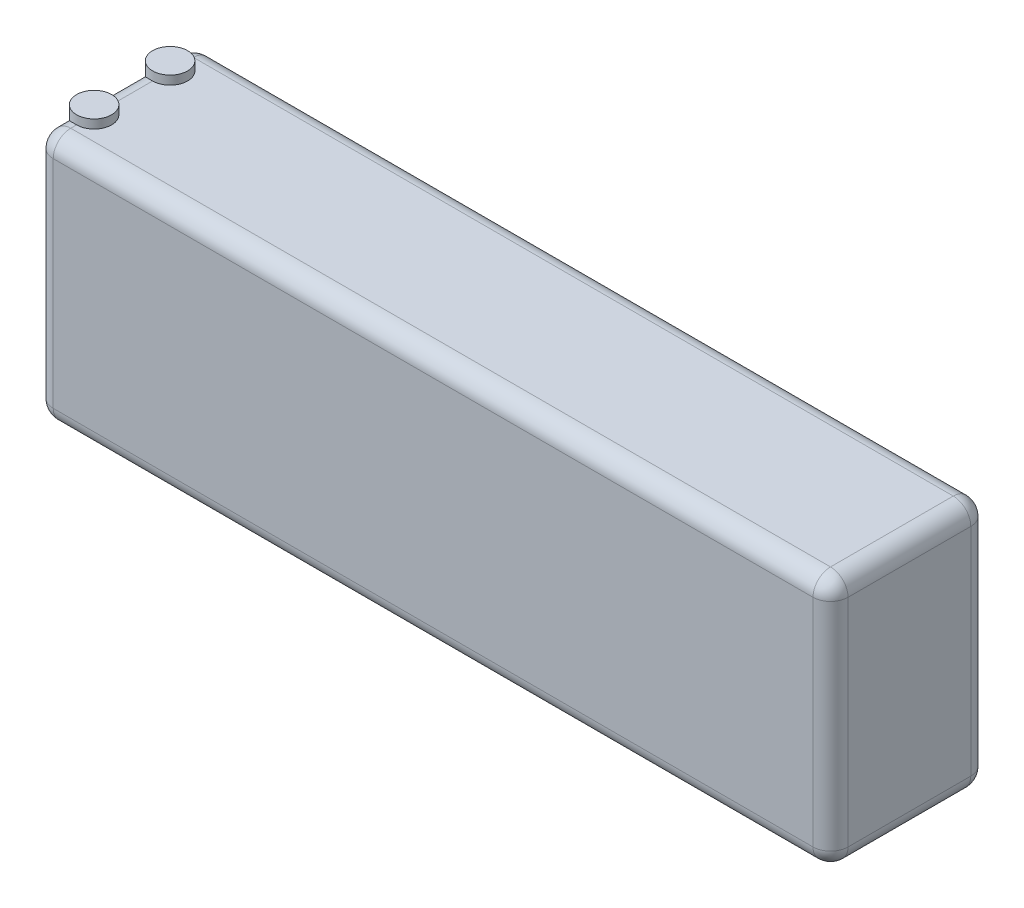
ISO-10303-21;
HEADER;
FILE_DESCRIPTION(('STEP AP214'),'2;1');
FILE_NAME('part.step','',(''),(''),'','','');
FILE_SCHEMA(('AUTOMOTIVE_DESIGN { 1 0 10303 214 1 1 1 1 }'));
ENDSEC;
DATA;
#1=APPLICATION_CONTEXT('core data for automotive mechanical design processes');
#2=APPLICATION_PROTOCOL_DEFINITION('international standard','automotive_design',2000,#1);
#3=PRODUCT_CONTEXT('',#1,'mechanical');
#4=PRODUCT('Part','Part','',(#3));
#5=PRODUCT_RELATED_PRODUCT_CATEGORY('part','',(#4));
#6=PRODUCT_DEFINITION_FORMATION('','',#4);
#7=PRODUCT_DEFINITION_CONTEXT('part definition',#1,'design');
#8=PRODUCT_DEFINITION('design','',#6,#7);
#9=PRODUCT_DEFINITION_SHAPE('','',#8);
#10=(LENGTH_UNIT() NAMED_UNIT(*) SI_UNIT(.MILLI.,.METRE.));
#11=(NAMED_UNIT(*) PLANE_ANGLE_UNIT() SI_UNIT($,.RADIAN.));
#12=(NAMED_UNIT(*) SI_UNIT($,.STERADIAN.) SOLID_ANGLE_UNIT());
#13=UNCERTAINTY_MEASURE_WITH_UNIT(LENGTH_MEASURE(1.E-05),#10,'distance_accuracy_value','');
#14=(GEOMETRIC_REPRESENTATION_CONTEXT(3) GLOBAL_UNCERTAINTY_ASSIGNED_CONTEXT((#13)) GLOBAL_UNIT_ASSIGNED_CONTEXT((#10,
#11,#12)) REPRESENTATION_CONTEXT('',''));
#15=CARTESIAN_POINT('',(0.,0.,0.));
#16=DIRECTION('',(0.,0.,1.));
#17=DIRECTION('',(1.,0.,0.));
#18=AXIS2_PLACEMENT_3D('',#15,#16,#17);
#19=CARTESIAN_POINT('',(68.,-21.5,0.));
#20=DIRECTION('',(1.,0.,0.));
#21=DIRECTION('',(0.,1.,0.));
#22=AXIS2_PLACEMENT_3D('',#19,#20,#21);
#23=PLANE('',#22);
#24=DIRECTION('',(0.,0.,-1.));
#25=VECTOR('',#24,1.);
#26=CARTESIAN_POINT('',(68.,18.5,0.));
#27=LINE('',#26,#25);
#28=CARTESIAN_POINT('',(68.,18.5,24.));
#29=VERTEX_POINT('',#28);
#30=CARTESIAN_POINT('',(68.,18.5,3.));
#31=VERTEX_POINT('',#30);
#32=EDGE_CURVE('E311',#29,#31,#27,.T.);
#33=ORIENTED_EDGE('',*,*,#32,.F.);
#34=DIRECTION('',(0.,1.,0.));
#35=VECTOR('',#34,1.);
#36=CARTESIAN_POINT('',(68.,-10.75,24.));
#37=LINE('',#36,#35);
#38=CARTESIAN_POINT('',(68.,-18.5,24.));
#39=VERTEX_POINT('',#38);
#40=EDGE_CURVE('E352',#39,#29,#37,.T.);
#41=ORIENTED_EDGE('',*,*,#40,.F.);
#42=DIRECTION('',(0.,0.,1.));
#43=VECTOR('',#42,1.);
#44=CARTESIAN_POINT('',(68.,-18.5,0.));
#45=LINE('',#44,#43);
#46=CARTESIAN_POINT('',(68.,-18.5,3.));
#47=VERTEX_POINT('',#46);
#48=EDGE_CURVE('E322',#47,#39,#45,.T.);
#49=ORIENTED_EDGE('',*,*,#48,.F.);
#50=DIRECTION('',(0.,-1.,0.));
#51=VECTOR('',#50,1.);
#52=CARTESIAN_POINT('',(68.,-10.75,3.));
#53=LINE('',#52,#51);
#54=EDGE_CURVE('E144',#31,#47,#53,.T.);
#55=ORIENTED_EDGE('',*,*,#54,.F.);
#56=EDGE_LOOP('',(#33,#41,#49,#55));
#57=FACE_BOUND('',#56,.T.);
#58=ADVANCED_FACE('F17',(#57),#23,.T.);
#59=CARTESIAN_POINT('',(0.,0.,27.));
#60=DIRECTION('',(0.,0.,1.));
#61=DIRECTION('',(1.,0.,0.));
#62=AXIS2_PLACEMENT_3D('',#59,#60,#61);
#63=PLANE('',#62);
#64=DIRECTION('',(0.,1.,0.));
#65=VECTOR('',#64,1.);
#66=CARTESIAN_POINT('',(-65.,10.75,27.));
#67=LINE('',#66,#65);
#68=CARTESIAN_POINT('',(-65.,-18.5,27.));
#69=VERTEX_POINT('',#68);
#70=CARTESIAN_POINT('',(-65.,18.5,27.));
#71=VERTEX_POINT('',#70);
#72=EDGE_CURVE('E302',#69,#71,#67,.T.);
#73=ORIENTED_EDGE('',*,*,#72,.F.);
#74=DIRECTION('',(-1.,0.,0.));
#75=VECTOR('',#74,1.);
#76=CARTESIAN_POINT('',(-34.,-18.5,27.));
#77=LINE('',#76,#75);
#78=CARTESIAN_POINT('',(65.,-18.5,27.));
#79=VERTEX_POINT('',#78);
#80=EDGE_CURVE('E197',#79,#69,#77,.T.);
#81=ORIENTED_EDGE('',*,*,#80,.F.);
#82=DIRECTION('',(0.,-1.,0.));
#83=VECTOR('',#82,1.);
#84=CARTESIAN_POINT('',(65.,-10.75,27.));
#85=LINE('',#84,#83);
#86=CARTESIAN_POINT('',(65.,18.5,27.));
#87=VERTEX_POINT('',#86);
#88=EDGE_CURVE('E39',#87,#79,#85,.T.);
#89=ORIENTED_EDGE('',*,*,#88,.F.);
#90=DIRECTION('',(1.,0.,0.));
#91=VECTOR('',#90,1.);
#92=CARTESIAN_POINT('',(34.,18.5,27.));
#93=LINE('',#92,#91);
#94=EDGE_CURVE('E348',#71,#87,#93,.T.);
#95=ORIENTED_EDGE('',*,*,#94,.F.);
#96=EDGE_LOOP('',(#73,#81,#89,#95));
#97=FACE_BOUND('',#96,.T.);
#98=ADVANCED_FACE('F464',(#97),#63,.T.);
#99=CARTESIAN_POINT('',(-68.,21.5,0.));
#100=DIRECTION('',(-1.,0.,0.));
#101=DIRECTION('',(0.,0.,1.));
#102=AXIS2_PLACEMENT_3D('',#99,#100,#101);
#103=PLANE('',#102);
#104=DIRECTION('',(0.,0.,1.));
#105=VECTOR('',#104,1.);
#106=CARTESIAN_POINT('',(-68.,18.5,0.));
#107=LINE('',#106,#105);
#108=CARTESIAN_POINT('',(-68.,18.5,3.));
#109=VERTEX_POINT('',#108);
#110=CARTESIAN_POINT('',(-68.,18.5,24.));
#111=VERTEX_POINT('',#110);
#112=EDGE_CURVE('E219',#109,#111,#107,.T.);
#113=ORIENTED_EDGE('',*,*,#112,.F.);
#114=DIRECTION('',(0.,1.,0.));
#115=VECTOR('',#114,1.);
#116=CARTESIAN_POINT('',(-68.,10.75,3.));
#117=LINE('',#116,#115);
#118=CARTESIAN_POINT('',(-68.,-18.5,3.));
#119=VERTEX_POINT('',#118);
#120=EDGE_CURVE('E214',#119,#109,#117,.T.);
#121=ORIENTED_EDGE('',*,*,#120,.F.);
#122=DIRECTION('',(0.,0.,-1.));
#123=VECTOR('',#122,1.);
#124=CARTESIAN_POINT('',(-68.,-18.5,0.));
#125=LINE('',#124,#123);
#126=CARTESIAN_POINT('',(-68.,-18.5,24.));
#127=VERTEX_POINT('',#126);
#128=EDGE_CURVE('E217',#127,#119,#125,.T.);
#129=ORIENTED_EDGE('',*,*,#128,.F.);
#130=DIRECTION('',(0.,-1.,0.));
#131=VECTOR('',#130,1.);
#132=CARTESIAN_POINT('',(-68.,10.75,24.));
#133=LINE('',#132,#131);
#134=EDGE_CURVE('E192',#111,#127,#133,.T.);
#135=ORIENTED_EDGE('',*,*,#134,.F.);
#136=EDGE_LOOP('',(#113,#121,#129,#135));
#137=FACE_BOUND('',#136,.T.);
#138=ADVANCED_FACE('F216',(#137),#103,.T.);
#139=CARTESIAN_POINT('',(-68.,-21.5,0.));
#140=DIRECTION('',(0.,-1.,0.));
#141=DIRECTION('',(0.,0.,-1.));
#142=AXIS2_PLACEMENT_3D('',#139,#140,#141);
#143=PLANE('',#142);
#144=DIRECTION('',(0.,0.,-1.));
#145=VECTOR('',#144,1.);
#146=CARTESIAN_POINT('',(65.,-21.5,0.));
#147=LINE('',#146,#145);
#148=CARTESIAN_POINT('',(65.,-21.5,24.));
#149=VERTEX_POINT('',#148);
#150=CARTESIAN_POINT('',(65.,-21.5,3.));
#151=VERTEX_POINT('',#150);
#152=EDGE_CURVE('E327',#149,#151,#147,.T.);
#153=ORIENTED_EDGE('',*,*,#152,.F.);
#154=DIRECTION('',(1.,0.,0.));
#155=VECTOR('',#154,1.);
#156=CARTESIAN_POINT('',(-34.,-21.5,24.));
#157=LINE('',#156,#155);
#158=CARTESIAN_POINT('',(-65.,-21.5,24.));
#159=VERTEX_POINT('',#158);
#160=EDGE_CURVE('E133',#159,#149,#157,.T.);
#161=ORIENTED_EDGE('',*,*,#160,.F.);
#162=DIRECTION('',(0.,0.,1.));
#163=VECTOR('',#162,1.);
#164=CARTESIAN_POINT('',(-65.,-21.5,0.));
#165=LINE('',#164,#163);
#166=CARTESIAN_POINT('',(-65.,-21.5,3.));
#167=VERTEX_POINT('',#166);
#168=EDGE_CURVE('E237',#167,#159,#165,.T.);
#169=ORIENTED_EDGE('',*,*,#168,.F.);
#170=DIRECTION('',(-1.,0.,0.));
#171=VECTOR('',#170,1.);
#172=CARTESIAN_POINT('',(-34.,-21.5,3.));
#173=LINE('',#172,#171);
#174=EDGE_CURVE('E11',#151,#167,#173,.T.);
#175=ORIENTED_EDGE('',*,*,#174,.F.);
#176=EDGE_LOOP('',(#153,#161,#169,#175));
#177=FACE_BOUND('',#176,.T.);
#178=ADVANCED_FACE('F540',(#177),#143,.T.);
#179=CARTESIAN_POINT('',(0.,0.,0.));
#180=DIRECTION('',(0.,0.,1.));
#181=DIRECTION('',(1.,0.,0.));
#182=AXIS2_PLACEMENT_3D('',#179,#180,#181);
#183=PLANE('',#182);
#184=DIRECTION('',(-1.,0.,0.));
#185=VECTOR('',#184,1.);
#186=CARTESIAN_POINT('',(34.,18.5,0.));
#187=LINE('',#186,#185);
#188=CARTESIAN_POINT('',(65.,18.5,0.));
#189=VERTEX_POINT('',#188);
#190=CARTESIAN_POINT('',(-65.,18.5,0.));
#191=VERTEX_POINT('',#190);
#192=EDGE_CURVE('E269',#189,#191,#187,.T.);
#193=ORIENTED_EDGE('',*,*,#192,.F.);
#194=DIRECTION('',(0.,1.,0.));
#195=VECTOR('',#194,1.);
#196=CARTESIAN_POINT('',(65.,-10.75,0.));
#197=LINE('',#196,#195);
#198=CARTESIAN_POINT('',(65.,-18.5,0.));
#199=VERTEX_POINT('',#198);
#200=EDGE_CURVE('E293',#199,#189,#197,.T.);
#201=ORIENTED_EDGE('',*,*,#200,.F.);
#202=DIRECTION('',(1.,0.,0.));
#203=VECTOR('',#202,1.);
#204=CARTESIAN_POINT('',(-34.,-18.5,0.));
#205=LINE('',#204,#203);
#206=CARTESIAN_POINT('',(-65.,-18.5,0.));
#207=VERTEX_POINT('',#206);
#208=EDGE_CURVE('E26',#207,#199,#205,.T.);
#209=ORIENTED_EDGE('',*,*,#208,.F.);
#210=DIRECTION('',(0.,-1.,0.));
#211=VECTOR('',#210,1.);
#212=CARTESIAN_POINT('',(-65.,10.75,0.));
#213=LINE('',#212,#211);
#214=EDGE_CURVE('E225',#191,#207,#213,.T.);
#215=ORIENTED_EDGE('',*,*,#214,.F.);
#216=EDGE_LOOP('',(#193,#201,#209,#215));
#217=FACE_BOUND('',#216,.T.);
#218=ADVANCED_FACE('F531',(#217),#183,.F.);
#219=CARTESIAN_POINT('',(-34.,-18.5,3.));
#220=DIRECTION('',(-1.,0.,0.));
#221=DIRECTION('',(0.,-0.707106781186548,-0.707106781186547));
#222=AXIS2_PLACEMENT_3D('',#219,#220,#221);
#223=CYLINDRICAL_SURFACE('',#222,3.);
#224=CARTESIAN_POINT('',(-65.,-18.5,3.));
#225=DIRECTION('',(1.,0.,0.));
#226=DIRECTION('',(0.,-1.,0.));
#227=AXIS2_PLACEMENT_3D('',#224,#225,#226);
#228=CIRCLE('',#227,3.);
#229=EDGE_CURVE('E244',#167,#207,#228,.T.);
#230=ORIENTED_EDGE('',*,*,#229,.T.);
#231=ORIENTED_EDGE('',*,*,#208,.T.);
#232=CARTESIAN_POINT('',(65.,-18.5,3.));
#233=DIRECTION('',(-1.,0.,0.));
#234=DIRECTION('',(0.,0.,-1.));
#235=AXIS2_PLACEMENT_3D('',#232,#233,#234);
#236=CIRCLE('',#235,3.);
#237=EDGE_CURVE('E246',#199,#151,#236,.T.);
#238=ORIENTED_EDGE('',*,*,#237,.T.);
#239=ORIENTED_EDGE('',*,*,#174,.T.);
#240=EDGE_LOOP('',(#230,#231,#238,#239));
#241=FACE_BOUND('',#240,.T.);
#242=ADVANCED_FACE('F528',(#241),#223,.T.);
#243=CARTESIAN_POINT('',(-65.,10.75,3.));
#244=DIRECTION('',(0.,1.,0.));
#245=DIRECTION('',(-0.707106781186546,0.,-0.707106781186549));
#246=AXIS2_PLACEMENT_3D('',#243,#244,#245);
#247=CYLINDRICAL_SURFACE('',#246,3.);
#248=CARTESIAN_POINT('',(-65.,18.5,3.));
#249=DIRECTION('',(0.,-1.,0.));
#250=DIRECTION('',(-1.,0.,0.));
#251=AXIS2_PLACEMENT_3D('',#248,#249,#250);
#252=CIRCLE('',#251,3.);
#253=EDGE_CURVE('E286',#109,#191,#252,.T.);
#254=ORIENTED_EDGE('',*,*,#253,.T.);
#255=ORIENTED_EDGE('',*,*,#214,.T.);
#256=CARTESIAN_POINT('',(-65.,-18.5,3.));
#257=DIRECTION('',(0.,1.,0.));
#258=DIRECTION('',(0.,0.,-1.));
#259=AXIS2_PLACEMENT_3D('',#256,#257,#258);
#260=CIRCLE('',#259,3.);
#261=EDGE_CURVE('E243',#207,#119,#260,.T.);
#262=ORIENTED_EDGE('',*,*,#261,.T.);
#263=ORIENTED_EDGE('',*,*,#120,.T.);
#264=EDGE_LOOP('',(#254,#255,#262,#263));
#265=FACE_BOUND('',#264,.T.);
#266=ADVANCED_FACE('F248',(#265),#247,.T.);
#267=CARTESIAN_POINT('',(65.,-10.75,3.));
#268=DIRECTION('',(0.,-1.,0.));
#269=DIRECTION('',(0.707106781186546,0.,-0.707106781186549));
#270=AXIS2_PLACEMENT_3D('',#267,#268,#269);
#271=CYLINDRICAL_SURFACE('',#270,3.);
#272=CARTESIAN_POINT('',(65.,-18.5,3.));
#273=DIRECTION('',(0.,1.,0.));
#274=DIRECTION('',(1.,0.,0.));
#275=AXIS2_PLACEMENT_3D('',#272,#273,#274);
#276=CIRCLE('',#275,3.);
#277=EDGE_CURVE('E402',#47,#199,#276,.T.);
#278=ORIENTED_EDGE('',*,*,#277,.T.);
#279=ORIENTED_EDGE('',*,*,#200,.T.);
#280=CARTESIAN_POINT('',(65.,18.5,3.));
#281=DIRECTION('',(0.,-1.,0.));
#282=DIRECTION('',(0.,0.,-1.));
#283=AXIS2_PLACEMENT_3D('',#280,#281,#282);
#284=CIRCLE('',#283,3.);
#285=EDGE_CURVE('E294',#189,#31,#284,.T.);
#286=ORIENTED_EDGE('',*,*,#285,.T.);
#287=ORIENTED_EDGE('',*,*,#54,.T.);
#288=EDGE_LOOP('',(#278,#279,#286,#287));
#289=FACE_BOUND('',#288,.T.);
#290=ADVANCED_FACE('F556',(#289),#271,.T.);
#291=CARTESIAN_POINT('',(-34.,-18.5,24.));
#292=DIRECTION('',(1.,0.,0.));
#293=DIRECTION('',(0.,-0.707106781186548,0.707106781186547));
#294=AXIS2_PLACEMENT_3D('',#291,#292,#293);
#295=CYLINDRICAL_SURFACE('',#294,3.);
#296=CARTESIAN_POINT('',(65.,-18.5,24.));
#297=DIRECTION('',(-1.,0.,0.));
#298=DIRECTION('',(0.,-1.,0.));
#299=AXIS2_PLACEMENT_3D('',#296,#297,#298);
#300=CIRCLE('',#299,3.);
#301=EDGE_CURVE('E265',#149,#79,#300,.T.);
#302=ORIENTED_EDGE('',*,*,#301,.T.);
#303=ORIENTED_EDGE('',*,*,#80,.T.);
#304=CARTESIAN_POINT('',(-65.,-18.5,24.));
#305=DIRECTION('',(1.,0.,0.));
#306=DIRECTION('',(0.,0.,1.));
#307=AXIS2_PLACEMENT_3D('',#304,#305,#306);
#308=CIRCLE('',#307,3.);
#309=EDGE_CURVE('E238',#69,#159,#308,.T.);
#310=ORIENTED_EDGE('',*,*,#309,.T.);
#311=ORIENTED_EDGE('',*,*,#160,.T.);
#312=EDGE_LOOP('',(#302,#303,#310,#311));
#313=FACE_BOUND('',#312,.T.);
#314=ADVANCED_FACE('F558',(#313),#295,.T.);
#315=CARTESIAN_POINT('',(65.,-10.75,24.));
#316=DIRECTION('',(0.,1.,0.));
#317=DIRECTION('',(0.707106781186547,0.,0.707106781186548));
#318=AXIS2_PLACEMENT_3D('',#315,#316,#317);
#319=CYLINDRICAL_SURFACE('',#318,3.);
#320=CARTESIAN_POINT('',(65.,18.5,24.));
#321=DIRECTION('',(0.,-1.,0.));
#322=DIRECTION('',(1.,0.,0.));
#323=AXIS2_PLACEMENT_3D('',#320,#321,#322);
#324=CIRCLE('',#323,3.);
#325=EDGE_CURVE('E301',#29,#87,#324,.T.);
#326=ORIENTED_EDGE('',*,*,#325,.T.);
#327=ORIENTED_EDGE('',*,*,#88,.T.);
#328=CARTESIAN_POINT('',(65.,-18.5,24.));
#329=DIRECTION('',(0.,1.,0.));
#330=DIRECTION('',(0.,0.,1.));
#331=AXIS2_PLACEMENT_3D('',#328,#329,#330);
#332=CIRCLE('',#331,3.);
#333=EDGE_CURVE('E354',#79,#39,#332,.T.);
#334=ORIENTED_EDGE('',*,*,#333,.T.);
#335=ORIENTED_EDGE('',*,*,#40,.T.);
#336=EDGE_LOOP('',(#326,#327,#334,#335));
#337=FACE_BOUND('',#336,.T.);
#338=ADVANCED_FACE('F455',(#337),#319,.T.);
#339=CARTESIAN_POINT('',(34.,18.5,24.));
#340=DIRECTION('',(-1.,0.,0.));
#341=DIRECTION('',(0.,0.707106781186548,0.707106781186547));
#342=AXIS2_PLACEMENT_3D('',#339,#340,#341);
#343=CYLINDRICAL_SURFACE('',#342,3.);
#344=CARTESIAN_POINT('',(-65.,18.5,24.));
#345=DIRECTION('',(1.,0.,0.));
#346=DIRECTION('',(0.,1.,0.));
#347=AXIS2_PLACEMENT_3D('',#344,#345,#346);
#348=CIRCLE('',#347,3.);
#349=CARTESIAN_POINT('',(-65.,21.5,24.));
#350=VERTEX_POINT('',#349);
#351=EDGE_CURVE('E326',#350,#71,#348,.T.);
#352=ORIENTED_EDGE('',*,*,#351,.T.);
#353=ORIENTED_EDGE('',*,*,#94,.T.);
#354=CARTESIAN_POINT('',(65.,18.5,24.));
#355=DIRECTION('',(-1.,0.,0.));
#356=DIRECTION('',(0.,0.,1.));
#357=AXIS2_PLACEMENT_3D('',#354,#355,#356);
#358=CIRCLE('',#357,3.);
#359=CARTESIAN_POINT('',(65.,21.5,24.));
#360=VERTEX_POINT('',#359);
#361=EDGE_CURVE('E308',#87,#360,#358,.T.);
#362=ORIENTED_EDGE('',*,*,#361,.T.);
#363=DIRECTION('',(-1.,0.,0.));
#364=VECTOR('',#363,1.);
#365=CARTESIAN_POINT('',(34.,21.5,24.));
#366=LINE('',#365,#364);
#367=EDGE_CURVE('E385',#360,#350,#366,.T.);
#368=ORIENTED_EDGE('',*,*,#367,.T.);
#369=EDGE_LOOP('',(#352,#353,#362,#368));
#370=FACE_BOUND('',#369,.T.);
#371=ADVANCED_FACE('F462',(#370),#343,.T.);
#372=CARTESIAN_POINT('',(65.,18.5,0.));
#373=DIRECTION('',(0.,0.,1.));
#374=DIRECTION('',(0.707106781186549,0.707106781186546,0.));
#375=AXIS2_PLACEMENT_3D('',#372,#373,#374);
#376=CYLINDRICAL_SURFACE('',#375,3.);
#377=CARTESIAN_POINT('',(65.,18.5,24.));
#378=DIRECTION('',(0.,0.,-1.));
#379=DIRECTION('',(0.,1.,0.));
#380=AXIS2_PLACEMENT_3D('',#377,#378,#379);
#381=CIRCLE('',#380,3.);
#382=EDGE_CURVE('E312',#360,#29,#381,.T.);
#383=ORIENTED_EDGE('',*,*,#382,.T.);
#384=ORIENTED_EDGE('',*,*,#32,.T.);
#385=CARTESIAN_POINT('',(65.,18.5,3.));
#386=DIRECTION('',(0.,0.,1.));
#387=DIRECTION('',(1.,0.,0.));
#388=AXIS2_PLACEMENT_3D('',#385,#386,#387);
#389=CIRCLE('',#388,3.);
#390=CARTESIAN_POINT('',(65.,21.5,3.));
#391=VERTEX_POINT('',#390);
#392=EDGE_CURVE('E339',#31,#391,#389,.T.);
#393=ORIENTED_EDGE('',*,*,#392,.T.);
#394=DIRECTION('',(0.,0.,1.));
#395=VECTOR('',#394,1.);
#396=CARTESIAN_POINT('',(65.,21.5,0.));
#397=LINE('',#396,#395);
#398=EDGE_CURVE('E290',#391,#360,#397,.T.);
#399=ORIENTED_EDGE('',*,*,#398,.T.);
#400=EDGE_LOOP('',(#383,#384,#393,#399));
#401=FACE_BOUND('',#400,.T.);
#402=ADVANCED_FACE('F496',(#401),#376,.T.);
#403=CARTESIAN_POINT('',(65.,18.5,24.));
#404=DIRECTION('',(0.408248290463864,0.408248290463861,-0.816496580927726));
#405=DIRECTION('',(0.577350269189628,0.577350269189624,0.577350269189625));
#406=AXIS2_PLACEMENT_3D('',#403,#404,#405);
#407=SPHERICAL_SURFACE('',#406,3.);
#408=ORIENTED_EDGE('',*,*,#325,.F.);
#409=ORIENTED_EDGE('',*,*,#382,.F.);
#410=ORIENTED_EDGE('',*,*,#361,.F.);
#411=EDGE_LOOP('',(#408,#409,#410));
#412=FACE_BOUND('',#411,.T.);
#413=ADVANCED_FACE('F460',(#412),#407,.T.);
#414=CARTESIAN_POINT('',(-65.,10.75,24.));
#415=DIRECTION('',(0.,-1.,0.));
#416=DIRECTION('',(-0.707106781186547,0.,0.707106781186548));
#417=AXIS2_PLACEMENT_3D('',#414,#415,#416);
#418=CYLINDRICAL_SURFACE('',#417,3.);
#419=CARTESIAN_POINT('',(-65.,-18.5,24.));
#420=DIRECTION('',(0.,1.,0.));
#421=DIRECTION('',(-1.,0.,0.));
#422=AXIS2_PLACEMENT_3D('',#419,#420,#421);
#423=CIRCLE('',#422,3.);
#424=EDGE_CURVE('E283',#127,#69,#423,.T.);
#425=ORIENTED_EDGE('',*,*,#424,.T.);
#426=ORIENTED_EDGE('',*,*,#72,.T.);
#427=CARTESIAN_POINT('',(-65.,18.5,24.));
#428=DIRECTION('',(0.,-1.,0.));
#429=DIRECTION('',(0.,0.,1.));
#430=AXIS2_PLACEMENT_3D('',#427,#428,#429);
#431=CIRCLE('',#430,3.);
#432=EDGE_CURVE('E340',#71,#111,#431,.T.);
#433=ORIENTED_EDGE('',*,*,#432,.T.);
#434=ORIENTED_EDGE('',*,*,#134,.T.);
#435=EDGE_LOOP('',(#425,#426,#433,#434));
#436=FACE_BOUND('',#435,.T.);
#437=ADVANCED_FACE('F467',(#436),#418,.T.);
#438=CARTESIAN_POINT('',(-65.,18.5,0.));
#439=DIRECTION('',(0.,0.,1.));
#440=DIRECTION('',(-0.707106781186549,0.707106781186546,0.));
#441=AXIS2_PLACEMENT_3D('',#438,#439,#440);
#442=CYLINDRICAL_SURFACE('',#441,3.);
#443=CARTESIAN_POINT('',(-65.,18.5,7.));
#444=DIRECTION('',(0.,-0.707106781186548,-0.707106781186548));
#445=DIRECTION('',(0.,-0.707106781186548,0.707106781186548));
#446=AXIS2_PLACEMENT_3D('',#443,#444,#445);
#447=ELLIPSE('',#446,4.24264068711929,3.);
#448=CARTESIAN_POINT('',(-67.5980762113532,20.,5.49999999999973));
#449=VERTEX_POINT('',#448);
#450=CARTESIAN_POINT('',(-65.,21.5,4.));
#451=VERTEX_POINT('',#450);
#452=EDGE_CURVE('E307',#449,#451,#447,.T.);
#453=ORIENTED_EDGE('',*,*,#452,.T.);
#454=DIRECTION('',(0.,0.,-1.));
#455=VECTOR('',#454,1.);
#456=CARTESIAN_POINT('',(-65.,21.5,0.));
#457=LINE('',#456,#455);
#458=CARTESIAN_POINT('',(-65.,21.5,3.));
#459=VERTEX_POINT('',#458);
#460=EDGE_CURVE('E250',#451,#459,#457,.T.);
#461=ORIENTED_EDGE('',*,*,#460,.T.);
#462=CARTESIAN_POINT('',(-65.,18.5,3.));
#463=DIRECTION('',(0.,0.,1.));
#464=DIRECTION('',(0.,1.,0.));
#465=AXIS2_PLACEMENT_3D('',#462,#463,#464);
#466=CIRCLE('',#465,3.);
#467=EDGE_CURVE('E321',#459,#109,#466,.T.);
#468=ORIENTED_EDGE('',*,*,#467,.T.);
#469=ORIENTED_EDGE('',*,*,#112,.T.);
#470=CARTESIAN_POINT('',(-65.,18.5,24.));
#471=DIRECTION('',(0.,0.,-1.));
#472=DIRECTION('',(-1.,0.,0.));
#473=AXIS2_PLACEMENT_3D('',#470,#471,#472);
#474=CIRCLE('',#473,3.);
#475=EDGE_CURVE('E70',#111,#350,#474,.T.);
#476=ORIENTED_EDGE('',*,*,#475,.T.);
#477=DIRECTION('',(0.,0.,-1.));
#478=VECTOR('',#477,1.);
#479=CARTESIAN_POINT('',(-65.,21.5,0.));
#480=LINE('',#479,#478);
#481=CARTESIAN_POINT('',(-65.,21.5,23.));
#482=VERTEX_POINT('',#481);
#483=EDGE_CURVE('E83',#350,#482,#480,.T.);
#484=ORIENTED_EDGE('',*,*,#483,.T.);
#485=CARTESIAN_POINT('',(-65.,18.5,20.));
#486=DIRECTION('',(0.,-0.707106781186547,0.707106781186548));
#487=DIRECTION('',(0.,0.707106781186548,0.707106781186547));
#488=AXIS2_PLACEMENT_3D('',#485,#486,#487);
#489=ELLIPSE('',#488,4.24264068711929,3.);
#490=CARTESIAN_POINT('',(-67.5980762113533,20.,21.5));
#491=VERTEX_POINT('',#490);
#492=EDGE_CURVE('E328',#482,#491,#489,.T.);
#493=ORIENTED_EDGE('',*,*,#492,.T.);
#494=DIRECTION('',(0.,0.,-1.));
#495=VECTOR('',#494,1.);
#496=CARTESIAN_POINT('',(-67.5980762113533,20.,0.));
#497=LINE('',#496,#495);
#498=CARTESIAN_POINT('',(-67.5980762113533,20.,18.5));
#499=VERTEX_POINT('',#498);
#500=EDGE_CURVE('E275',#491,#499,#497,.T.);
#501=ORIENTED_EDGE('',*,*,#500,.T.);
#502=CARTESIAN_POINT('',(-65.,18.5,20.));
#503=DIRECTION('',(0.,-0.707106781186547,-0.707106781186548));
#504=DIRECTION('',(0.,-0.707106781186548,0.707106781186547));
#505=AXIS2_PLACEMENT_3D('',#502,#503,#504);
#506=ELLIPSE('',#505,4.24264068711928,3.);
#507=CARTESIAN_POINT('',(-65.,21.5,17.));
#508=VERTEX_POINT('',#507);
#509=EDGE_CURVE('E332',#499,#508,#506,.T.);
#510=ORIENTED_EDGE('',*,*,#509,.T.);
#511=DIRECTION('',(0.,0.,-1.));
#512=VECTOR('',#511,1.);
#513=CARTESIAN_POINT('',(-65.,21.5,0.));
#514=LINE('',#513,#512);
#515=CARTESIAN_POINT('',(-65.,21.5,10.));
#516=VERTEX_POINT('',#515);
#517=EDGE_CURVE('E376',#508,#516,#514,.T.);
#518=ORIENTED_EDGE('',*,*,#517,.T.);
#519=CARTESIAN_POINT('',(-65.,18.5,7.));
#520=DIRECTION('',(0.,-0.707106781186547,0.707106781186548));
#521=DIRECTION('',(0.,0.707106781186548,0.707106781186547));
#522=AXIS2_PLACEMENT_3D('',#519,#520,#521);
#523=ELLIPSE('',#522,4.24264068711929,3.);
#524=CARTESIAN_POINT('',(-67.5980762113532,20.,8.50000000000027));
#525=VERTEX_POINT('',#524);
#526=EDGE_CURVE('E280',#516,#525,#523,.T.);
#527=ORIENTED_EDGE('',*,*,#526,.T.);
#528=DIRECTION('',(0.,0.,-1.));
#529=VECTOR('',#528,1.);
#530=CARTESIAN_POINT('',(-67.5980762113533,20.,0.));
#531=LINE('',#530,#529);
#532=EDGE_CURVE('E379',#525,#449,#531,.T.);
#533=ORIENTED_EDGE('',*,*,#532,.T.);
#534=EDGE_LOOP('',(#453,#461,#468,#469,#476,#484,#493,#501,#510,#518,#527,#533));
#535=FACE_BOUND('',#534,.T.);
#536=ADVANCED_FACE('F472',(#535),#442,.T.);
#537=CARTESIAN_POINT('',(-65.,18.5,24.));
#538=DIRECTION('',(-0.408248290463864,0.40824829046386,-0.816496580927727));
#539=DIRECTION('',(-0.57735026918963,0.577350269189623,0.577350269189624));
#540=AXIS2_PLACEMENT_3D('',#537,#538,#539);
#541=SPHERICAL_SURFACE('',#540,3.);
#542=ORIENTED_EDGE('',*,*,#351,.F.);
#543=ORIENTED_EDGE('',*,*,#475,.F.);
#544=ORIENTED_EDGE('',*,*,#432,.F.);
#545=EDGE_LOOP('',(#542,#543,#544));
#546=FACE_BOUND('',#545,.T.);
#547=ADVANCED_FACE('F469',(#546),#541,.T.);
#548=CARTESIAN_POINT('',(65.,-18.5,0.));
#549=DIRECTION('',(0.,0.,1.));
#550=DIRECTION('',(0.707106781186549,-0.707106781186546,0.));
#551=AXIS2_PLACEMENT_3D('',#548,#549,#550);
#552=CYLINDRICAL_SURFACE('',#551,3.);
#553=CARTESIAN_POINT('',(65.,-18.5,24.));
#554=DIRECTION('',(0.,0.,-1.));
#555=DIRECTION('',(1.,0.,0.));
#556=AXIS2_PLACEMENT_3D('',#553,#554,#555);
#557=CIRCLE('',#556,3.);
#558=EDGE_CURVE('E268',#39,#149,#557,.T.);
#559=ORIENTED_EDGE('',*,*,#558,.T.);
#560=ORIENTED_EDGE('',*,*,#152,.T.);
#561=CARTESIAN_POINT('',(65.,-18.5,3.));
#562=DIRECTION('',(0.,0.,1.));
#563=DIRECTION('',(0.,-1.,0.));
#564=AXIS2_PLACEMENT_3D('',#561,#562,#563);
#565=CIRCLE('',#564,3.);
#566=EDGE_CURVE('E408',#151,#47,#565,.T.);
#567=ORIENTED_EDGE('',*,*,#566,.T.);
#568=ORIENTED_EDGE('',*,*,#48,.T.);
#569=EDGE_LOOP('',(#559,#560,#567,#568));
#570=FACE_BOUND('',#569,.T.);
#571=ADVANCED_FACE('F471',(#570),#552,.T.);
#572=CARTESIAN_POINT('',(65.,-18.5,24.));
#573=DIRECTION('',(0.408248290463864,-0.40824829046386,-0.816496580927727));
#574=DIRECTION('',(0.57735026918963,-0.577350269189623,0.577350269189624));
#575=AXIS2_PLACEMENT_3D('',#572,#573,#574);
#576=SPHERICAL_SURFACE('',#575,3.);
#577=ORIENTED_EDGE('',*,*,#301,.F.);
#578=ORIENTED_EDGE('',*,*,#558,.F.);
#579=ORIENTED_EDGE('',*,*,#333,.F.);
#580=EDGE_LOOP('',(#577,#578,#579));
#581=FACE_BOUND('',#580,.T.);
#582=ADVANCED_FACE('F479',(#581),#576,.T.);
#583=CARTESIAN_POINT('',(34.,18.5,3.));
#584=DIRECTION('',(1.,0.,0.));
#585=DIRECTION('',(0.,0.707106781186548,-0.707106781186547));
#586=AXIS2_PLACEMENT_3D('',#583,#584,#585);
#587=CYLINDRICAL_SURFACE('',#586,3.);
#588=CARTESIAN_POINT('',(65.,18.5,3.));
#589=DIRECTION('',(-1.,0.,0.));
#590=DIRECTION('',(0.,1.,0.));
#591=AXIS2_PLACEMENT_3D('',#588,#589,#590);
#592=CIRCLE('',#591,3.);
#593=EDGE_CURVE('E297',#391,#189,#592,.T.);
#594=ORIENTED_EDGE('',*,*,#593,.T.);
#595=ORIENTED_EDGE('',*,*,#192,.T.);
#596=CARTESIAN_POINT('',(-65.,18.5,3.));
#597=DIRECTION('',(1.,0.,0.));
#598=DIRECTION('',(0.,0.,-1.));
#599=AXIS2_PLACEMENT_3D('',#596,#597,#598);
#600=CIRCLE('',#599,3.);
#601=EDGE_CURVE('E318',#191,#459,#600,.T.);
#602=ORIENTED_EDGE('',*,*,#601,.T.);
#603=DIRECTION('',(1.,0.,0.));
#604=VECTOR('',#603,1.);
#605=CARTESIAN_POINT('',(34.,21.5,3.));
#606=LINE('',#605,#604);
#607=EDGE_CURVE('E259',#459,#391,#606,.T.);
#608=ORIENTED_EDGE('',*,*,#607,.T.);
#609=EDGE_LOOP('',(#594,#595,#602,#608));
#610=FACE_BOUND('',#609,.T.);
#611=ADVANCED_FACE('F543',(#610),#587,.T.);
#612=CARTESIAN_POINT('',(65.,18.5,3.));
#613=DIRECTION('',(-0.408248290463864,-0.408248290463862,-0.816496580927726));
#614=DIRECTION('',(0.577350269189628,0.577350269189625,-0.577350269189625));
#615=AXIS2_PLACEMENT_3D('',#612,#613,#614);
#616=SPHERICAL_SURFACE('',#615,3.);
#617=ORIENTED_EDGE('',*,*,#285,.F.);
#618=ORIENTED_EDGE('',*,*,#593,.F.);
#619=ORIENTED_EDGE('',*,*,#392,.F.);
#620=EDGE_LOOP('',(#617,#618,#619));
#621=FACE_BOUND('',#620,.T.);
#622=ADVANCED_FACE('F546',(#621),#616,.T.);
#623=CARTESIAN_POINT('',(-65.,-18.5,0.));
#624=DIRECTION('',(0.,0.,1.));
#625=DIRECTION('',(-0.707106781186549,-0.707106781186546,0.));
#626=AXIS2_PLACEMENT_3D('',#623,#624,#625);
#627=CYLINDRICAL_SURFACE('',#626,3.);
#628=CARTESIAN_POINT('',(-65.,-18.5,24.));
#629=DIRECTION('',(0.,0.,-1.));
#630=DIRECTION('',(0.,-1.,0.));
#631=AXIS2_PLACEMENT_3D('',#628,#629,#630);
#632=CIRCLE('',#631,3.);
#633=EDGE_CURVE('E234',#159,#127,#632,.T.);
#634=ORIENTED_EDGE('',*,*,#633,.T.);
#635=ORIENTED_EDGE('',*,*,#128,.T.);
#636=CARTESIAN_POINT('',(-65.,-18.5,3.));
#637=DIRECTION('',(0.,0.,1.));
#638=DIRECTION('',(-1.,0.,0.));
#639=AXIS2_PLACEMENT_3D('',#636,#637,#638);
#640=CIRCLE('',#639,3.);
#641=EDGE_CURVE('E231',#119,#167,#640,.T.);
#642=ORIENTED_EDGE('',*,*,#641,.T.);
#643=ORIENTED_EDGE('',*,*,#168,.T.);
#644=EDGE_LOOP('',(#634,#635,#642,#643));
#645=FACE_BOUND('',#644,.T.);
#646=ADVANCED_FACE('F230',(#645),#627,.T.);
#647=CARTESIAN_POINT('',(-65.,-18.5,24.));
#648=DIRECTION('',(-0.408248290463864,-0.408248290463861,-0.816496580927726));
#649=DIRECTION('',(-0.577350269189628,-0.577350269189624,0.577350269189625));
#650=AXIS2_PLACEMENT_3D('',#647,#648,#649);
#651=SPHERICAL_SURFACE('',#650,3.);
#652=ORIENTED_EDGE('',*,*,#424,.F.);
#653=ORIENTED_EDGE('',*,*,#633,.F.);
#654=ORIENTED_EDGE('',*,*,#309,.F.);
#655=EDGE_LOOP('',(#652,#653,#654));
#656=FACE_BOUND('',#655,.T.);
#657=ADVANCED_FACE('F526',(#656),#651,.T.);
#658=CARTESIAN_POINT('',(-65.,18.5,3.));
#659=DIRECTION('',(-0.816496580927729,-0.40824829046386,0.40824829046386));
#660=DIRECTION('',(-0.577350269189622,0.577350269189628,-0.577350269189628));
#661=AXIS2_PLACEMENT_3D('',#658,#659,#660);
#662=SPHERICAL_SURFACE('',#661,3.);
#663=ORIENTED_EDGE('',*,*,#467,.F.);
#664=ORIENTED_EDGE('',*,*,#601,.F.);
#665=ORIENTED_EDGE('',*,*,#253,.F.);
#666=EDGE_LOOP('',(#663,#664,#665));
#667=FACE_BOUND('',#666,.T.);
#668=ADVANCED_FACE('F550',(#667),#662,.T.);
#669=CARTESIAN_POINT('',(65.,-18.5,3.));
#670=DIRECTION('',(-0.408248290463862,-0.816496580927726,0.408248290463864));
#671=DIRECTION('',(0.577350269189624,-0.577350269189626,-0.577350269189628));
#672=AXIS2_PLACEMENT_3D('',#669,#670,#671);
#673=SPHERICAL_SURFACE('',#672,3.);
#674=ORIENTED_EDGE('',*,*,#237,.F.);
#675=ORIENTED_EDGE('',*,*,#277,.F.);
#676=ORIENTED_EDGE('',*,*,#566,.F.);
#677=EDGE_LOOP('',(#674,#675,#676));
#678=FACE_BOUND('',#677,.T.);
#679=ADVANCED_FACE('F537',(#678),#673,.T.);
#680=CARTESIAN_POINT('',(-65.,-18.5,3.));
#681=DIRECTION('',(0.408248290463864,0.408248290463862,-0.816496580927726));
#682=DIRECTION('',(-0.577350269189628,-0.577350269189625,-0.577350269189625));
#683=AXIS2_PLACEMENT_3D('',#680,#681,#682);
#684=SPHERICAL_SURFACE('',#683,3.);
#685=ORIENTED_EDGE('',*,*,#261,.F.);
#686=ORIENTED_EDGE('',*,*,#229,.F.);
#687=ORIENTED_EDGE('',*,*,#641,.F.);
#688=EDGE_LOOP('',(#685,#686,#687));
#689=FACE_BOUND('',#688,.T.);
#690=ADVANCED_FACE('F242',(#689),#684,.T.);
#691=CARTESIAN_POINT('',(68.,21.5,0.));
#692=DIRECTION('',(0.,1.,0.));
#693=DIRECTION('',(1.,0.,0.));
#694=AXIS2_PLACEMENT_3D('',#691,#692,#693);
#695=PLANE('',#694);
#696=CARTESIAN_POINT('',(-65.,21.5,7.));
#697=DIRECTION('',(0.,-1.,0.));
#698=DIRECTION('',(-1.,0.,0.));
#699=AXIS2_PLACEMENT_3D('',#696,#697,#698);
#700=CIRCLE('',#699,3.);
#701=CARTESIAN_POINT('',(-62.,21.5,7.));
#702=VERTEX_POINT('',#701);
#703=EDGE_CURVE('E303',#451,#702,#700,.T.);
#704=ORIENTED_EDGE('',*,*,#703,.T.);
#705=CARTESIAN_POINT('',(-65.,21.5,7.));
#706=DIRECTION('',(0.,-1.,0.));
#707=DIRECTION('',(-1.,0.,0.));
#708=AXIS2_PLACEMENT_3D('',#705,#706,#707);
#709=CIRCLE('',#708,3.);
#710=EDGE_CURVE('E276',#702,#516,#709,.T.);
#711=ORIENTED_EDGE('',*,*,#710,.T.);
#712=ORIENTED_EDGE('',*,*,#517,.F.);
#713=CARTESIAN_POINT('',(-65.,21.5,20.));
#714=DIRECTION('',(0.,-1.,0.));
#715=DIRECTION('',(-1.,0.,0.));
#716=AXIS2_PLACEMENT_3D('',#713,#714,#715);
#717=CIRCLE('',#716,3.);
#718=CARTESIAN_POINT('',(-62.,21.5,20.));
#719=VERTEX_POINT('',#718);
#720=EDGE_CURVE('E388',#508,#719,#717,.T.);
#721=ORIENTED_EDGE('',*,*,#720,.T.);
#722=CARTESIAN_POINT('',(-65.,21.5,20.));
#723=DIRECTION('',(0.,-1.,0.));
#724=DIRECTION('',(-1.,0.,0.));
#725=AXIS2_PLACEMENT_3D('',#722,#723,#724);
#726=CIRCLE('',#725,3.);
#727=EDGE_CURVE('E331',#719,#482,#726,.T.);
#728=ORIENTED_EDGE('',*,*,#727,.T.);
#729=ORIENTED_EDGE('',*,*,#483,.F.);
#730=ORIENTED_EDGE('',*,*,#367,.F.);
#731=ORIENTED_EDGE('',*,*,#398,.F.);
#732=ORIENTED_EDGE('',*,*,#607,.F.);
#733=ORIENTED_EDGE('',*,*,#460,.F.);
#734=EDGE_LOOP('',(#704,#711,#712,#721,#728,#729,#730,#731,#732,#733));
#735=FACE_BOUND('',#734,.T.);
#736=ADVANCED_FACE('F501',(#735),#695,.T.);
#737=CARTESIAN_POINT('',(-65.,23.,20.));
#738=DIRECTION('',(0.,1.,0.));
#739=DIRECTION('',(1.,0.,0.));
#740=AXIS2_PLACEMENT_3D('',#737,#738,#739);
#741=PLANE('',#740);
#742=CARTESIAN_POINT('',(-65.,23.,20.));
#743=DIRECTION('',(0.,1.,0.));
#744=DIRECTION('',(-1.,0.,0.));
#745=AXIS2_PLACEMENT_3D('',#742,#743,#744);
#746=CIRCLE('',#745,3.);
#747=CARTESIAN_POINT('',(-62.,23.,20.));
#748=VERTEX_POINT('',#747);
#749=EDGE_CURVE('E274',#748,#748,#746,.T.);
#750=ORIENTED_EDGE('',*,*,#749,.T.);
#751=EDGE_LOOP('',(#750));
#752=FACE_BOUND('',#751,.T.);
#753=ADVANCED_FACE('F522',(#752),#741,.T.);
#754=CARTESIAN_POINT('',(-65.,21.5,20.));
#755=DIRECTION('',(0.,1.,0.));
#756=DIRECTION('',(-1.,0.,0.));
#757=AXIS2_PLACEMENT_3D('',#754,#755,#756);
#758=CYLINDRICAL_SURFACE('',#757,3.);
#759=ORIENTED_EDGE('',*,*,#749,.F.);
#760=DIRECTION('',(0.,-1.,0.));
#761=VECTOR('',#760,1.);
#762=CARTESIAN_POINT('',(-62.,21.5,20.));
#763=LINE('',#762,#761);
#764=EDGE_CURVE('E392',#748,#719,#763,.T.);
#765=ORIENTED_EDGE('',*,*,#764,.T.);
#766=ORIENTED_EDGE('',*,*,#720,.F.);
#767=ORIENTED_EDGE('',*,*,#509,.F.);
#768=CARTESIAN_POINT('',(-65.,20.,20.));
#769=DIRECTION('',(0.,-1.,0.));
#770=DIRECTION('',(-1.,0.,0.));
#771=AXIS2_PLACEMENT_3D('',#768,#769,#770);
#772=CIRCLE('',#771,3.);
#773=EDGE_CURVE('E270',#491,#499,#772,.T.);
#774=ORIENTED_EDGE('',*,*,#773,.F.);
#775=ORIENTED_EDGE('',*,*,#492,.F.);
#776=ORIENTED_EDGE('',*,*,#727,.F.);
#777=ORIENTED_EDGE('',*,*,#764,.F.);
#778=EDGE_LOOP('',(#759,#765,#766,#767,#774,#775,#776,#777));
#779=FACE_BOUND('',#778,.T.);
#780=ADVANCED_FACE('F507',(#779),#758,.T.);
#781=CARTESIAN_POINT('',(-65.,20.,20.));
#782=DIRECTION('',(0.,1.,0.));
#783=DIRECTION('',(1.,0.,0.));
#784=AXIS2_PLACEMENT_3D('',#781,#782,#783);
#785=PLANE('',#784);
#786=ORIENTED_EDGE('',*,*,#500,.F.);
#787=ORIENTED_EDGE('',*,*,#773,.T.);
#788=EDGE_LOOP('',(#786,#787));
#789=FACE_BOUND('',#788,.T.);
#790=ADVANCED_FACE('F510',(#789),#785,.F.);
#791=CARTESIAN_POINT('',(-65.,23.,7.));
#792=DIRECTION('',(0.,1.,0.));
#793=DIRECTION('',(1.,0.,0.));
#794=AXIS2_PLACEMENT_3D('',#791,#792,#793);
#795=PLANE('',#794);
#796=CARTESIAN_POINT('',(-65.,23.,7.));
#797=DIRECTION('',(0.,1.,0.));
#798=DIRECTION('',(-1.,0.,0.));
#799=AXIS2_PLACEMENT_3D('',#796,#797,#798);
#800=CIRCLE('',#799,3.);
#801=CARTESIAN_POINT('',(-62.,23.,7.));
#802=VERTEX_POINT('',#801);
#803=EDGE_CURVE('E313',#802,#802,#800,.T.);
#804=ORIENTED_EDGE('',*,*,#803,.T.);
#805=EDGE_LOOP('',(#804));
#806=FACE_BOUND('',#805,.T.);
#807=ADVANCED_FACE('F512',(#806),#795,.T.);
#808=CARTESIAN_POINT('',(-65.,21.5,7.));
#809=DIRECTION('',(0.,1.,0.));
#810=DIRECTION('',(-1.,0.,0.));
#811=AXIS2_PLACEMENT_3D('',#808,#809,#810);
#812=CYLINDRICAL_SURFACE('',#811,3.);
#813=ORIENTED_EDGE('',*,*,#803,.F.);
#814=DIRECTION('',(0.,-1.,0.));
#815=VECTOR('',#814,1.);
#816=CARTESIAN_POINT('',(-62.,21.5,7.));
#817=LINE('',#816,#815);
#818=EDGE_CURVE('E263',#802,#702,#817,.T.);
#819=ORIENTED_EDGE('',*,*,#818,.T.);
#820=ORIENTED_EDGE('',*,*,#703,.F.);
#821=ORIENTED_EDGE('',*,*,#452,.F.);
#822=CARTESIAN_POINT('',(-65.,20.,7.));
#823=DIRECTION('',(0.,-1.,0.));
#824=DIRECTION('',(-1.,0.,0.));
#825=AXIS2_PLACEMENT_3D('',#822,#823,#824);
#826=CIRCLE('',#825,3.);
#827=EDGE_CURVE('E317',#525,#449,#826,.T.);
#828=ORIENTED_EDGE('',*,*,#827,.F.);
#829=ORIENTED_EDGE('',*,*,#526,.F.);
#830=ORIENTED_EDGE('',*,*,#710,.F.);
#831=ORIENTED_EDGE('',*,*,#818,.F.);
#832=EDGE_LOOP('',(#813,#819,#820,#821,#828,#829,#830,#831));
#833=FACE_BOUND('',#832,.T.);
#834=ADVANCED_FACE('F518',(#833),#812,.T.);
#835=CARTESIAN_POINT('',(-65.,20.,7.));
#836=DIRECTION('',(0.,1.,0.));
#837=DIRECTION('',(1.,0.,0.));
#838=AXIS2_PLACEMENT_3D('',#835,#836,#837);
#839=PLANE('',#838);
#840=ORIENTED_EDGE('',*,*,#532,.F.);
#841=ORIENTED_EDGE('',*,*,#827,.T.);
#842=EDGE_LOOP('',(#840,#841));
#843=FACE_BOUND('',#842,.T.);
#844=ADVANCED_FACE('F568',(#843),#839,.F.);
#845=CLOSED_SHELL('',(#58,#98,#138,#178,#218,#242,#266,#290,#314,#338,#371,#402,#413,#437,#536,
#547,#571,#582,#611,#622,#646,#657,#668,#679,#690,#736,#753,#780,#790,#807,#834,#844));
#846=MANIFOLD_SOLID_BREP('B1',#845);
#847=ADVANCED_BREP_SHAPE_REPRESENTATION('',(#18,#846),#14);
#848=SHAPE_DEFINITION_REPRESENTATION(#9,#847);
ENDSEC;
END-ISO-10303-21;
